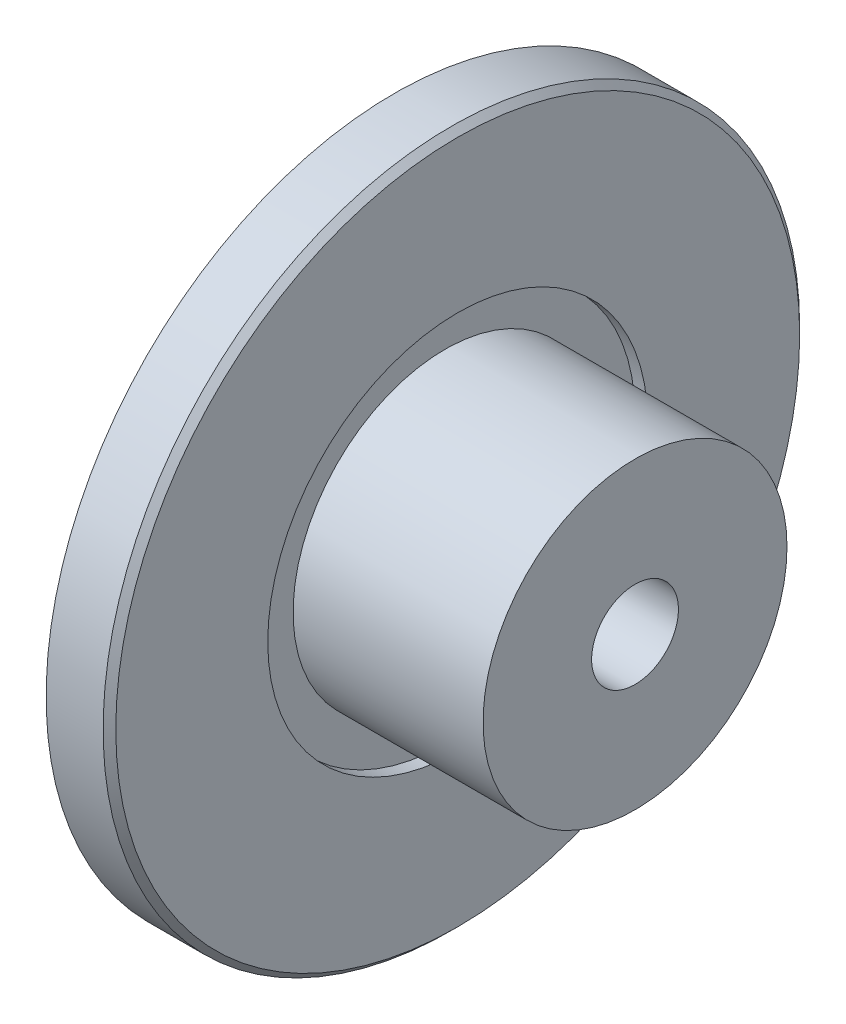
ISO-10303-21;
HEADER;
FILE_DESCRIPTION(('STEP AP214'),'2;1');
FILE_NAME('part.step','',(''),(''),'','','');
FILE_SCHEMA(('AUTOMOTIVE_DESIGN { 1 0 10303 214 1 1 1 1 }'));
ENDSEC;
DATA;
#1=APPLICATION_CONTEXT('core data for automotive mechanical design processes');
#2=APPLICATION_PROTOCOL_DEFINITION('international standard','automotive_design',2000,#1);
#3=PRODUCT_CONTEXT('',#1,'mechanical');
#4=PRODUCT('Part','Part','',(#3));
#5=PRODUCT_RELATED_PRODUCT_CATEGORY('part','',(#4));
#6=PRODUCT_DEFINITION_FORMATION('','',#4);
#7=PRODUCT_DEFINITION_CONTEXT('part definition',#1,'design');
#8=PRODUCT_DEFINITION('design','',#6,#7);
#9=PRODUCT_DEFINITION_SHAPE('','',#8);
#10=(LENGTH_UNIT() NAMED_UNIT(*) SI_UNIT(.MILLI.,.METRE.));
#11=(NAMED_UNIT(*) PLANE_ANGLE_UNIT() SI_UNIT($,.RADIAN.));
#12=(NAMED_UNIT(*) SI_UNIT($,.STERADIAN.) SOLID_ANGLE_UNIT());
#13=UNCERTAINTY_MEASURE_WITH_UNIT(LENGTH_MEASURE(1.E-05),#10,'distance_accuracy_value','');
#14=(GEOMETRIC_REPRESENTATION_CONTEXT(3) GLOBAL_UNCERTAINTY_ASSIGNED_CONTEXT((#13)) GLOBAL_UNIT_ASSIGNED_CONTEXT((#10,
#11,#12)) REPRESENTATION_CONTEXT('',''));
#15=CARTESIAN_POINT('',(0.,0.,0.));
#16=DIRECTION('',(0.,0.,1.));
#17=DIRECTION('',(1.,0.,0.));
#18=AXIS2_PLACEMENT_3D('',#15,#16,#17);
#19=CARTESIAN_POINT('',(4.,0.,0.));
#20=DIRECTION('',(1.,0.,0.));
#21=DIRECTION('',(0.,0.,-1.));
#22=AXIS2_PLACEMENT_3D('',#19,#20,#21);
#23=PLANE('',#22);
#24=CARTESIAN_POINT('',(4.,0.,0.));
#25=DIRECTION('',(1.,0.,0.));
#26=DIRECTION('',(0.,0.,-1.));
#27=AXIS2_PLACEMENT_3D('',#24,#25,#26);
#28=CIRCLE('',#27,15.);
#29=CARTESIAN_POINT('',(4.,0.,-15.));
#30=VERTEX_POINT('',#29);
#31=EDGE_CURVE('E52',#30,#30,#28,.F.);
#32=ORIENTED_EDGE('',*,*,#31,.F.);
#33=EDGE_LOOP('',(#32));
#34=FACE_BOUND('',#33,.T.);
#35=CARTESIAN_POINT('',(4.,0.,0.));
#36=DIRECTION('',(1.,0.,0.));
#37=DIRECTION('',(0.,0.,-1.));
#38=AXIS2_PLACEMENT_3D('',#35,#36,#37);
#39=CIRCLE('',#38,12.);
#40=CARTESIAN_POINT('',(4.,0.,-12.));
#41=VERTEX_POINT('',#40);
#42=EDGE_CURVE('E66',#41,#41,#39,.T.);
#43=ORIENTED_EDGE('',*,*,#42,.F.);
#44=EDGE_LOOP('',(#43));
#45=FACE_BOUND('',#44,.T.);
#46=ADVANCED_FACE('F41',(#34,#45),#23,.T.);
#47=CARTESIAN_POINT('',(4.,0.,0.));
#48=DIRECTION('',(-1.,0.,0.));
#49=DIRECTION('',(0.,0.,1.));
#50=AXIS2_PLACEMENT_3D('',#47,#48,#49);
#51=CYLINDRICAL_SURFACE('',#50,27.5);
#52=CARTESIAN_POINT('',(4.49999999999999,0.,0.));
#53=DIRECTION('',(1.,0.,0.));
#54=DIRECTION('',(0.,0.,-1.));
#55=AXIS2_PLACEMENT_3D('',#52,#53,#54);
#56=CIRCLE('',#55,27.5);
#57=CARTESIAN_POINT('',(4.49999999999999,0.,-27.5));
#58=VERTEX_POINT('',#57);
#59=EDGE_CURVE('E10',#58,#58,#56,.F.);
#60=ORIENTED_EDGE('',*,*,#59,.T.);
#61=EDGE_LOOP('',(#60));
#62=FACE_BOUND('',#61,.T.);
#63=CARTESIAN_POINT('',(0.,0.,0.));
#64=DIRECTION('',(1.,0.,0.));
#65=DIRECTION('',(0.,0.,-1.));
#66=AXIS2_PLACEMENT_3D('',#63,#64,#65);
#67=CIRCLE('',#66,27.5);
#68=CARTESIAN_POINT('',(0.,0.,-27.5));
#69=VERTEX_POINT('',#68);
#70=EDGE_CURVE('E60',#69,#69,#67,.T.);
#71=ORIENTED_EDGE('',*,*,#70,.T.);
#72=EDGE_LOOP('',(#71));
#73=FACE_BOUND('',#72,.T.);
#74=ADVANCED_FACE('F94',(#62,#73),#51,.T.);
#75=CARTESIAN_POINT('',(0.,0.,0.));
#76=DIRECTION('',(1.,0.,0.));
#77=DIRECTION('',(0.,0.,-1.));
#78=AXIS2_PLACEMENT_3D('',#75,#76,#77);
#79=PLANE('',#78);
#80=CARTESIAN_POINT('',(0.,0.,0.));
#81=DIRECTION('',(1.,0.,0.));
#82=DIRECTION('',(0.,0.,-1.));
#83=AXIS2_PLACEMENT_3D('',#80,#81,#82);
#84=CIRCLE('',#83,3.429);
#85=CARTESIAN_POINT('',(0.,0.,-3.429));
#86=VERTEX_POINT('',#85);
#87=EDGE_CURVE('E63',#86,#86,#84,.T.);
#88=ORIENTED_EDGE('',*,*,#87,.T.);
#89=EDGE_LOOP('',(#88));
#90=FACE_BOUND('',#89,.T.);
#91=ORIENTED_EDGE('',*,*,#70,.F.);
#92=EDGE_LOOP('',(#91));
#93=FACE_BOUND('',#92,.T.);
#94=ADVANCED_FACE('F105',(#90,#93),#79,.F.);
#95=CARTESIAN_POINT('',(5.,0.,0.));
#96=DIRECTION('',(1.,0.,0.));
#97=DIRECTION('',(0.,0.,-1.));
#98=AXIS2_PLACEMENT_3D('',#95,#96,#97);
#99=PLANE('',#98);
#100=CARTESIAN_POINT('',(5.,0.,0.));
#101=DIRECTION('',(1.,0.,0.));
#102=DIRECTION('',(0.,0.,-1.));
#103=AXIS2_PLACEMENT_3D('',#100,#101,#102);
#104=CIRCLE('',#103,27.);
#105=CARTESIAN_POINT('',(5.,0.,-27.));
#106=VERTEX_POINT('',#105);
#107=EDGE_CURVE('E47',#106,#106,#104,.T.);
#108=ORIENTED_EDGE('',*,*,#107,.T.);
#109=EDGE_LOOP('',(#108));
#110=FACE_BOUND('',#109,.T.);
#111=CARTESIAN_POINT('',(5.,0.,0.));
#112=DIRECTION('',(1.,0.,0.));
#113=DIRECTION('',(0.,0.,-1.));
#114=AXIS2_PLACEMENT_3D('',#111,#112,#113);
#115=CIRCLE('',#114,15.);
#116=CARTESIAN_POINT('',(5.,0.,-15.));
#117=VERTEX_POINT('',#116);
#118=EDGE_CURVE('E65',#117,#117,#115,.T.);
#119=ORIENTED_EDGE('',*,*,#118,.F.);
#120=EDGE_LOOP('',(#119));
#121=FACE_BOUND('',#120,.T.);
#122=ADVANCED_FACE('F110',(#110,#121),#99,.T.);
#123=CARTESIAN_POINT('',(5.,0.,0.));
#124=DIRECTION('',(-1.,0.,0.));
#125=DIRECTION('',(0.,0.,1.));
#126=AXIS2_PLACEMENT_3D('',#123,#124,#125);
#127=CYLINDRICAL_SURFACE('',#126,15.);
#128=ORIENTED_EDGE('',*,*,#118,.T.);
#129=EDGE_LOOP('',(#128));
#130=FACE_BOUND('',#129,.T.);
#131=ORIENTED_EDGE('',*,*,#31,.T.);
#132=EDGE_LOOP('',(#131));
#133=FACE_BOUND('',#132,.T.);
#134=ADVANCED_FACE('F91',(#130,#133),#127,.F.);
#135=CARTESIAN_POINT('',(5.,0.,0.));
#136=DIRECTION('',(-1.,0.,0.));
#137=DIRECTION('',(0.,0.,1.));
#138=AXIS2_PLACEMENT_3D('',#135,#136,#137);
#139=CYLINDRICAL_SURFACE('',#138,3.429);
#140=ORIENTED_EDGE('',*,*,#87,.F.);
#141=EDGE_LOOP('',(#140));
#142=FACE_BOUND('',#141,.T.);
#143=CARTESIAN_POINT('',(19.,0.,0.));
#144=DIRECTION('',(1.,0.,0.));
#145=DIRECTION('',(0.,0.,-1.));
#146=AXIS2_PLACEMENT_3D('',#143,#144,#145);
#147=CIRCLE('',#146,3.429);
#148=CARTESIAN_POINT('',(19.,0.,-3.429));
#149=VERTEX_POINT('',#148);
#150=EDGE_CURVE('E75',#149,#149,#147,.T.);
#151=ORIENTED_EDGE('',*,*,#150,.T.);
#152=EDGE_LOOP('',(#151));
#153=FACE_BOUND('',#152,.T.);
#154=ADVANCED_FACE('F76',(#142,#153),#139,.F.);
#155=CARTESIAN_POINT('',(19.,0.,0.));
#156=DIRECTION('',(1.,0.,0.));
#157=DIRECTION('',(0.,0.,-1.));
#158=AXIS2_PLACEMENT_3D('',#155,#156,#157);
#159=PLANE('',#158);
#160=CARTESIAN_POINT('',(19.,0.,0.));
#161=DIRECTION('',(1.,0.,0.));
#162=DIRECTION('',(0.,0.,-1.));
#163=AXIS2_PLACEMENT_3D('',#160,#161,#162);
#164=CIRCLE('',#163,12.);
#165=CARTESIAN_POINT('',(19.,0.,-12.));
#166=VERTEX_POINT('',#165);
#167=EDGE_CURVE('E69',#166,#166,#164,.T.);
#168=ORIENTED_EDGE('',*,*,#167,.T.);
#169=EDGE_LOOP('',(#168));
#170=FACE_BOUND('',#169,.T.);
#171=ORIENTED_EDGE('',*,*,#150,.F.);
#172=EDGE_LOOP('',(#171));
#173=FACE_BOUND('',#172,.T.);
#174=ADVANCED_FACE('F78',(#170,#173),#159,.T.);
#175=CARTESIAN_POINT('',(19.,0.,0.));
#176=DIRECTION('',(-1.,0.,0.));
#177=DIRECTION('',(0.,0.,1.));
#178=AXIS2_PLACEMENT_3D('',#175,#176,#177);
#179=CYLINDRICAL_SURFACE('',#178,12.);
#180=ORIENTED_EDGE('',*,*,#167,.F.);
#181=EDGE_LOOP('',(#180));
#182=FACE_BOUND('',#181,.T.);
#183=ORIENTED_EDGE('',*,*,#42,.T.);
#184=EDGE_LOOP('',(#183));
#185=FACE_BOUND('',#184,.T.);
#186=ADVANCED_FACE('F85',(#182,#185),#179,.T.);
#187=CARTESIAN_POINT('',(5.,0.,0.));
#188=DIRECTION('',(-1.,0.,0.));
#189=DIRECTION('',(0.,0.,1.));
#190=AXIS2_PLACEMENT_3D('',#187,#188,#189);
#191=CONICAL_SURFACE('',#190,27.,0.785398163397428);
#192=ORIENTED_EDGE('',*,*,#59,.F.);
#193=EDGE_LOOP('',(#192));
#194=FACE_BOUND('',#193,.T.);
#195=ORIENTED_EDGE('',*,*,#107,.F.);
#196=EDGE_LOOP('',(#195));
#197=FACE_BOUND('',#196,.T.);
#198=ADVANCED_FACE('F42',(#194,#197),#191,.T.);
#199=CLOSED_SHELL('',(#46,#74,#94,#122,#134,#154,#174,#186,#198));
#200=MANIFOLD_SOLID_BREP('B2',#199);
#201=ADVANCED_BREP_SHAPE_REPRESENTATION('',(#18,#200),#14);
#202=SHAPE_DEFINITION_REPRESENTATION(#9,#201);
ENDSEC;
END-ISO-10303-21;
